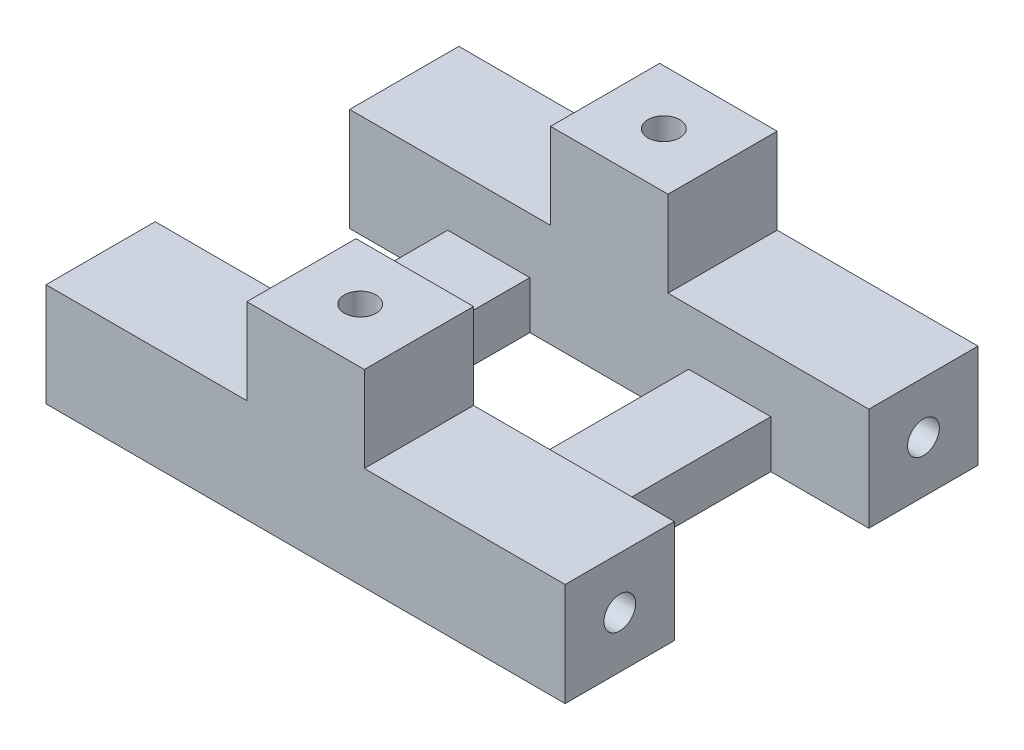
ISO-10303-21;
HEADER;
FILE_DESCRIPTION(('STEP AP214'),'2;1');
FILE_NAME('part.step','',(''),(''),'','','');
FILE_SCHEMA(('AUTOMOTIVE_DESIGN { 1 0 10303 214 1 1 1 1 }'));
ENDSEC;
DATA;
#1=APPLICATION_CONTEXT('core data for automotive mechanical design processes');
#2=APPLICATION_PROTOCOL_DEFINITION('international standard','automotive_design',2000,#1);
#3=PRODUCT_CONTEXT('',#1,'mechanical');
#4=PRODUCT('Part','Part','',(#3));
#5=PRODUCT_RELATED_PRODUCT_CATEGORY('part','',(#4));
#6=PRODUCT_DEFINITION_FORMATION('','',#4);
#7=PRODUCT_DEFINITION_CONTEXT('part definition',#1,'design');
#8=PRODUCT_DEFINITION('design','',#6,#7);
#9=PRODUCT_DEFINITION_SHAPE('','',#8);
#10=(LENGTH_UNIT() NAMED_UNIT(*) SI_UNIT(.MILLI.,.METRE.));
#11=(NAMED_UNIT(*) PLANE_ANGLE_UNIT() SI_UNIT($,.RADIAN.));
#12=(NAMED_UNIT(*) SI_UNIT($,.STERADIAN.) SOLID_ANGLE_UNIT());
#13=UNCERTAINTY_MEASURE_WITH_UNIT(LENGTH_MEASURE(1.E-05),#10,'distance_accuracy_value','');
#14=(GEOMETRIC_REPRESENTATION_CONTEXT(3) GLOBAL_UNCERTAINTY_ASSIGNED_CONTEXT((#13)) GLOBAL_UNIT_ASSIGNED_CONTEXT((#10,
#11,#12)) REPRESENTATION_CONTEXT('',''));
#15=CARTESIAN_POINT('',(0.,0.,0.));
#16=DIRECTION('',(0.,0.,1.));
#17=DIRECTION('',(1.,0.,0.));
#18=AXIS2_PLACEMENT_3D('',#15,#16,#17);
#19=CARTESIAN_POINT('',(0.,6.5,0.));
#20=DIRECTION('',(0.,1.,0.));
#21=DIRECTION('',(0.,0.,1.));
#22=AXIS2_PLACEMENT_3D('',#19,#20,#21);
#23=PLANE('',#22);
#24=DIRECTION('',(1.,0.,0.));
#25=VECTOR('',#24,1.);
#26=CARTESIAN_POINT('',(-15.6068074108547,6.5,-6.74432747551287));
#27=LINE('',#26,#25);
#28=CARTESIAN_POINT('',(-15.6068074108547,6.5,-6.74432747551287));
#29=VERTEX_POINT('',#28);
#30=CARTESIAN_POINT('',(-2.9568070293847,6.5,-6.74432747551274));
#31=VERTEX_POINT('',#30);
#32=EDGE_CURVE('E398',#29,#31,#27,.T.);
#33=ORIENTED_EDGE('',*,*,#32,.T.);
#34=DIRECTION('',(0.,0.,1.));
#35=VECTOR('',#34,1.);
#36=CARTESIAN_POINT('',(-2.9568070293847,6.5,-13.6193274755129));
#37=LINE('',#36,#35);
#38=CARTESIAN_POINT('',(-2.9568070293847,6.5,-13.6193274755129));
#39=VERTEX_POINT('',#38);
#40=EDGE_CURVE('E282',#39,#31,#37,.T.);
#41=ORIENTED_EDGE('',*,*,#40,.F.);
#42=DIRECTION('',(-1.,0.,0.));
#43=VECTOR('',#42,1.);
#44=CARTESIAN_POINT('',(17.0931933520853,6.5,-13.6193274755129));
#45=LINE('',#44,#43);
#46=CARTESIAN_POINT('',(-15.6068074108547,6.5,-13.6193274755129));
#47=VERTEX_POINT('',#46);
#48=EDGE_CURVE('E395',#39,#47,#45,.T.);
#49=ORIENTED_EDGE('',*,*,#48,.T.);
#50=DIRECTION('',(0.,0.,1.));
#51=VECTOR('',#50,1.);
#52=CARTESIAN_POINT('',(-15.6068074108547,6.5,-13.6193274755129));
#53=LINE('',#52,#51);
#54=EDGE_CURVE('E394',#47,#29,#53,.T.);
#55=ORIENTED_EDGE('',*,*,#54,.T.);
#56=EDGE_LOOP('',(#33,#41,#49,#55));
#57=FACE_BOUND('',#56,.T.);
#58=ADVANCED_FACE('F39',(#57),#23,.T.);
#59=DIRECTION('',(0.,0.,-1.));
#60=VECTOR('',#59,1.);
#61=CARTESIAN_POINT('',(4.4431929706153,6.5,-13.6193274755129));
#62=LINE('',#61,#60);
#63=CARTESIAN_POINT('',(4.4431929706153,6.5,-6.74432747551274));
#64=VERTEX_POINT('',#63);
#65=CARTESIAN_POINT('',(4.4431929706153,6.5,-13.6193274755129));
#66=VERTEX_POINT('',#65);
#67=EDGE_CURVE('E288',#64,#66,#62,.T.);
#68=ORIENTED_EDGE('',*,*,#67,.F.);
#69=DIRECTION('',(1.,0.,0.));
#70=VECTOR('',#69,1.);
#71=CARTESIAN_POINT('',(10.918193161346,6.5,-6.74432747551061));
#72=LINE('',#71,#70);
#73=CARTESIAN_POINT('',(17.0931933520853,6.5,-6.74432747551061));
#74=VERTEX_POINT('',#73);
#75=EDGE_CURVE('E417',#64,#74,#72,.T.);
#76=ORIENTED_EDGE('',*,*,#75,.T.);
#77=DIRECTION('',(0.,0.,-1.));
#78=VECTOR('',#77,1.);
#79=CARTESIAN_POINT('',(17.0931933520853,6.5,-6.74432747551061));
#80=LINE('',#79,#78);
#81=CARTESIAN_POINT('',(17.0931933520853,6.5,-13.6193274755129));
#82=VERTEX_POINT('',#81);
#83=EDGE_CURVE('E420',#74,#82,#80,.T.);
#84=ORIENTED_EDGE('',*,*,#83,.T.);
#85=EDGE_CURVE('E390',#82,#66,#45,.T.);
#86=ORIENTED_EDGE('',*,*,#85,.T.);
#87=EDGE_LOOP('',(#68,#76,#84,#86));
#88=FACE_BOUND('',#87,.T.);
#89=ADVANCED_FACE('F571',(#88),#23,.T.);
#90=DIRECTION('',(0.,0.,1.));
#91=VECTOR('',#90,1.);
#92=CARTESIAN_POINT('',(-2.9568070293847,6.5,5.50567252448682));
#93=LINE('',#92,#91);
#94=CARTESIAN_POINT('',(-2.9568070293847,6.5,5.50567252448682));
#95=VERTEX_POINT('',#94);
#96=CARTESIAN_POINT('',(-2.9568070293847,6.5,12.3806725244867));
#97=VERTEX_POINT('',#96);
#98=EDGE_CURVE('E322',#95,#97,#93,.T.);
#99=ORIENTED_EDGE('',*,*,#98,.F.);
#100=DIRECTION('',(-1.,0.,0.));
#101=VECTOR('',#100,1.);
#102=CARTESIAN_POINT('',(-9.43180722011978,6.5,5.50567252448691));
#103=LINE('',#102,#101);
#104=CARTESIAN_POINT('',(-15.606807410854,6.5,5.50567252448715));
#105=VERTEX_POINT('',#104);
#106=EDGE_CURVE('E401',#95,#105,#103,.T.);
#107=ORIENTED_EDGE('',*,*,#106,.T.);
#108=DIRECTION('',(0.,0.,1.));
#109=VECTOR('',#108,1.);
#110=CARTESIAN_POINT('',(-15.606807410854,6.5,5.50567252448715));
#111=LINE('',#110,#109);
#112=CARTESIAN_POINT('',(-15.606807410854,6.5,12.3806725244867));
#113=VERTEX_POINT('',#112);
#114=EDGE_CURVE('E404',#105,#113,#111,.T.);
#115=ORIENTED_EDGE('',*,*,#114,.T.);
#116=DIRECTION('',(1.,0.,0.));
#117=VECTOR('',#116,1.);
#118=CARTESIAN_POINT('',(-15.606807410854,6.5,12.3806725244867));
#119=LINE('',#118,#117);
#120=EDGE_CURVE('E408',#113,#97,#119,.T.);
#121=ORIENTED_EDGE('',*,*,#120,.T.);
#122=EDGE_LOOP('',(#99,#107,#115,#121));
#123=FACE_BOUND('',#122,.T.);
#124=ADVANCED_FACE('F523',(#123),#23,.T.);
#125=DIRECTION('',(-1.,0.,0.));
#126=VECTOR('',#125,1.);
#127=CARTESIAN_POINT('',(17.093193352086,6.5,5.50567252448893));
#128=LINE('',#127,#126);
#129=CARTESIAN_POINT('',(17.093193352086,6.5,5.50567252448893));
#130=VERTEX_POINT('',#129);
#131=CARTESIAN_POINT('',(4.4431929706153,6.5,5.50567252448682));
#132=VERTEX_POINT('',#131);
#133=EDGE_CURVE('E414',#130,#132,#128,.T.);
#134=ORIENTED_EDGE('',*,*,#133,.T.);
#135=DIRECTION('',(0.,0.,-1.));
#136=VECTOR('',#135,1.);
#137=CARTESIAN_POINT('',(4.4431929706153,6.5,5.50567252448682));
#138=LINE('',#137,#136);
#139=CARTESIAN_POINT('',(4.4431929706153,6.5,12.3806725244867));
#140=VERTEX_POINT('',#139);
#141=EDGE_CURVE('E331',#140,#132,#138,.T.);
#142=ORIENTED_EDGE('',*,*,#141,.F.);
#143=CARTESIAN_POINT('',(17.093193352086,6.5,12.3806725244867));
#144=VERTEX_POINT('',#143);
#145=EDGE_CURVE('E407',#140,#144,#119,.T.);
#146=ORIENTED_EDGE('',*,*,#145,.T.);
#147=DIRECTION('',(0.,0.,-1.));
#148=VECTOR('',#147,1.);
#149=CARTESIAN_POINT('',(17.093193352086,6.5,12.3806725244867));
#150=LINE('',#149,#148);
#151=EDGE_CURVE('E411',#144,#130,#150,.T.);
#152=ORIENTED_EDGE('',*,*,#151,.T.);
#153=EDGE_LOOP('',(#134,#142,#146,#152));
#154=FACE_BOUND('',#153,.T.);
#155=ADVANCED_FACE('F493',(#154),#23,.T.);
#156=CARTESIAN_POINT('',(0.,0.,0.));
#157=DIRECTION('',(0.,1.,0.));
#158=DIRECTION('',(0.,0.,1.));
#159=AXIS2_PLACEMENT_3D('',#156,#157,#158);
#160=PLANE('',#159);
#161=DIRECTION('',(-1.,0.,0.));
#162=VECTOR('',#161,1.);
#163=CARTESIAN_POINT('',(17.0931933520853,0.,-13.6193274755129));
#164=LINE('',#163,#162);
#165=CARTESIAN_POINT('',(17.0931933520853,0.,-13.6193274755129));
#166=VERTEX_POINT('',#165);
#167=CARTESIAN_POINT('',(-15.6068074108547,0.,-13.6193274755129));
#168=VERTEX_POINT('',#167);
#169=EDGE_CURVE('E389',#166,#168,#164,.T.);
#170=ORIENTED_EDGE('',*,*,#169,.F.);
#171=DIRECTION('',(0.,0.,-1.));
#172=VECTOR('',#171,1.);
#173=CARTESIAN_POINT('',(17.0931933520853,0.,-6.74432747551061));
#174=LINE('',#173,#172);
#175=CARTESIAN_POINT('',(17.0931933520853,0.,-6.74432747551061));
#176=VERTEX_POINT('',#175);
#177=EDGE_CURVE('E461',#176,#166,#174,.T.);
#178=ORIENTED_EDGE('',*,*,#177,.F.);
#179=DIRECTION('',(1.,0.,0.));
#180=VECTOR('',#179,1.);
#181=CARTESIAN_POINT('',(10.918193161346,0.,-6.74432747551061));
#182=LINE('',#181,#180);
#183=CARTESIAN_POINT('',(10.918193161346,0.,-6.74432747551061));
#184=VERTEX_POINT('',#183);
#185=EDGE_CURVE('E458',#184,#176,#182,.T.);
#186=ORIENTED_EDGE('',*,*,#185,.F.);
#187=DIRECTION('',(0.,0.,-1.));
#188=VECTOR('',#187,1.);
#189=CARTESIAN_POINT('',(10.918193161346,0.,5.50567252448893));
#190=LINE('',#189,#188);
#191=CARTESIAN_POINT('',(10.918193161346,0.,5.50567252448893));
#192=VERTEX_POINT('',#191);
#193=EDGE_CURVE('E225',#192,#184,#190,.T.);
#194=ORIENTED_EDGE('',*,*,#193,.F.);
#195=DIRECTION('',(-1.,0.,0.));
#196=VECTOR('',#195,1.);
#197=CARTESIAN_POINT('',(17.093193352086,0.,5.50567252448893));
#198=LINE('',#197,#196);
#199=CARTESIAN_POINT('',(17.093193352086,0.,5.50567252448893));
#200=VERTEX_POINT('',#199);
#201=EDGE_CURVE('E452',#200,#192,#198,.T.);
#202=ORIENTED_EDGE('',*,*,#201,.F.);
#203=DIRECTION('',(0.,0.,-1.));
#204=VECTOR('',#203,1.);
#205=CARTESIAN_POINT('',(17.093193352086,0.,12.3806725244867));
#206=LINE('',#205,#204);
#207=CARTESIAN_POINT('',(17.093193352086,0.,12.3806725244867));
#208=VERTEX_POINT('',#207);
#209=EDGE_CURVE('E448',#208,#200,#206,.T.);
#210=ORIENTED_EDGE('',*,*,#209,.F.);
#211=DIRECTION('',(1.,0.,0.));
#212=VECTOR('',#211,1.);
#213=CARTESIAN_POINT('',(-15.606807410854,0.,12.3806725244867));
#214=LINE('',#213,#212);
#215=CARTESIAN_POINT('',(-15.606807410854,0.,12.3806725244867));
#216=VERTEX_POINT('',#215);
#217=EDGE_CURVE('E445',#216,#208,#214,.T.);
#218=ORIENTED_EDGE('',*,*,#217,.F.);
#219=DIRECTION('',(0.,0.,1.));
#220=VECTOR('',#219,1.);
#221=CARTESIAN_POINT('',(-15.606807410854,0.,5.50567252448715));
#222=LINE('',#221,#220);
#223=CARTESIAN_POINT('',(-15.606807410854,0.,5.50567252448715));
#224=VERTEX_POINT('',#223);
#225=EDGE_CURVE('E442',#224,#216,#222,.T.);
#226=ORIENTED_EDGE('',*,*,#225,.F.);
#227=DIRECTION('',(-1.,0.,0.));
#228=VECTOR('',#227,1.);
#229=CARTESIAN_POINT('',(-9.43180722011978,0.,5.50567252448691));
#230=LINE('',#229,#228);
#231=CARTESIAN_POINT('',(-9.43180722011978,0.,5.50567252448691));
#232=VERTEX_POINT('',#231);
#233=EDGE_CURVE('E438',#232,#224,#230,.T.);
#234=ORIENTED_EDGE('',*,*,#233,.F.);
#235=DIRECTION('',(0.,0.,1.));
#236=VECTOR('',#235,1.);
#237=CARTESIAN_POINT('',(-9.43180722011978,0.,-6.74432747551287));
#238=LINE('',#237,#236);
#239=CARTESIAN_POINT('',(-9.43180722011978,0.,-6.74432747551287));
#240=VERTEX_POINT('',#239);
#241=EDGE_CURVE('E434',#240,#232,#238,.T.);
#242=ORIENTED_EDGE('',*,*,#241,.F.);
#243=DIRECTION('',(1.,0.,0.));
#244=VECTOR('',#243,1.);
#245=CARTESIAN_POINT('',(-15.6068074108547,0.,-6.74432747551287));
#246=LINE('',#245,#244);
#247=CARTESIAN_POINT('',(-15.6068074108547,0.,-6.74432747551287));
#248=VERTEX_POINT('',#247);
#249=EDGE_CURVE('E430',#248,#240,#246,.T.);
#250=ORIENTED_EDGE('',*,*,#249,.F.);
#251=DIRECTION('',(0.,0.,1.));
#252=VECTOR('',#251,1.);
#253=CARTESIAN_POINT('',(-15.6068074108547,0.,-13.6193274755129));
#254=LINE('',#253,#252);
#255=EDGE_CURVE('E426',#168,#248,#254,.T.);
#256=ORIENTED_EDGE('',*,*,#255,.F.);
#257=EDGE_LOOP('',(#170,#178,#186,#194,#202,#210,#218,#226,#234,#242,#250,#256));
#258=FACE_BOUND('',#257,.T.);
#259=DIRECTION('',(0.,0.,1.));
#260=VECTOR('',#259,1.);
#261=CARTESIAN_POINT('',(-4.25680702938396,0.,-6.74432747551274));
#262=LINE('',#261,#260);
#263=CARTESIAN_POINT('',(-4.25680702938396,0.,-6.74432747551274));
#264=VERTEX_POINT('',#263);
#265=CARTESIAN_POINT('',(-4.25680702938396,0.,5.50567252448682));
#266=VERTEX_POINT('',#265);
#267=EDGE_CURVE('E362',#264,#266,#262,.T.);
#268=ORIENTED_EDGE('',*,*,#267,.T.);
#269=DIRECTION('',(1.,0.,0.));
#270=VECTOR('',#269,1.);
#271=CARTESIAN_POINT('',(-4.25680702938396,0.,5.50567252448682));
#272=LINE('',#271,#270);
#273=CARTESIAN_POINT('',(5.74319297061473,0.,5.50567252448682));
#274=VERTEX_POINT('',#273);
#275=EDGE_CURVE('E366',#266,#274,#272,.T.);
#276=ORIENTED_EDGE('',*,*,#275,.T.);
#277=DIRECTION('',(0.,0.,-1.));
#278=VECTOR('',#277,1.);
#279=CARTESIAN_POINT('',(5.74319297061473,0.,-6.74432747551274));
#280=LINE('',#279,#278);
#281=CARTESIAN_POINT('',(5.74319297061473,0.,-6.74432747551274));
#282=VERTEX_POINT('',#281);
#283=EDGE_CURVE('E370',#274,#282,#280,.T.);
#284=ORIENTED_EDGE('',*,*,#283,.T.);
#285=DIRECTION('',(-1.,0.,0.));
#286=VECTOR('',#285,1.);
#287=CARTESIAN_POINT('',(-4.25680702938396,0.,-6.74432747551274));
#288=LINE('',#287,#286);
#289=EDGE_CURVE('E374',#282,#264,#288,.T.);
#290=ORIENTED_EDGE('',*,*,#289,.T.);
#291=EDGE_LOOP('',(#268,#276,#284,#290));
#292=FACE_BOUND('',#291,.T.);
#293=ADVANCED_FACE('F474',(#258,#292),#160,.F.);
#294=CARTESIAN_POINT('',(17.0931933520853,6.5,-13.6193274755129));
#295=DIRECTION('',(0.,0.,1.));
#296=DIRECTION('',(1.,0.,0.));
#297=AXIS2_PLACEMENT_3D('',#294,#295,#296);
#298=PLANE('',#297);
#299=ORIENTED_EDGE('',*,*,#169,.T.);
#300=DIRECTION('',(0.,-1.,0.));
#301=VECTOR('',#300,1.);
#302=CARTESIAN_POINT('',(-15.6068074108547,6.5,-13.6193274755129));
#303=LINE('',#302,#301);
#304=EDGE_CURVE('E49',#47,#168,#303,.T.);
#305=ORIENTED_EDGE('',*,*,#304,.F.);
#306=ORIENTED_EDGE('',*,*,#48,.F.);
#307=DIRECTION('',(0.,-1.,0.));
#308=VECTOR('',#307,1.);
#309=CARTESIAN_POINT('',(-2.9568070293847,11.9,-13.6193274755129));
#310=LINE('',#309,#308);
#311=CARTESIAN_POINT('',(-2.9568070293847,11.9,-13.6193274755129));
#312=VERTEX_POINT('',#311);
#313=EDGE_CURVE('E297',#312,#39,#310,.T.);
#314=ORIENTED_EDGE('',*,*,#313,.F.);
#315=DIRECTION('',(-1.,0.,0.));
#316=VECTOR('',#315,1.);
#317=CARTESIAN_POINT('',(-2.9568070293847,11.9,-13.6193274755129));
#318=LINE('',#317,#316);
#319=CARTESIAN_POINT('',(4.4431929706153,11.9,-13.6193274755129));
#320=VERTEX_POINT('',#319);
#321=EDGE_CURVE('E294',#320,#312,#318,.T.);
#322=ORIENTED_EDGE('',*,*,#321,.F.);
#323=DIRECTION('',(0.,-1.,0.));
#324=VECTOR('',#323,1.);
#325=CARTESIAN_POINT('',(4.4431929706153,11.9,-13.6193274755129));
#326=LINE('',#325,#324);
#327=EDGE_CURVE('E305',#320,#66,#326,.T.);
#328=ORIENTED_EDGE('',*,*,#327,.T.);
#329=ORIENTED_EDGE('',*,*,#85,.F.);
#330=DIRECTION('',(0.,-1.,0.));
#331=VECTOR('',#330,1.);
#332=CARTESIAN_POINT('',(17.0931933520853,6.5,-13.6193274755129));
#333=LINE('',#332,#331);
#334=EDGE_CURVE('E235',#82,#166,#333,.T.);
#335=ORIENTED_EDGE('',*,*,#334,.T.);
#336=EDGE_LOOP('',(#299,#305,#306,#314,#322,#328,#329,#335));
#337=FACE_BOUND('',#336,.T.);
#338=ADVANCED_FACE('F41',(#337),#298,.F.);
#339=CARTESIAN_POINT('',(-15.6068074108547,6.5,-13.6193274755129));
#340=DIRECTION('',(1.,0.,0.));
#341=DIRECTION('',(0.,0.,-1.));
#342=AXIS2_PLACEMENT_3D('',#339,#340,#341);
#343=PLANE('',#342);
#344=CARTESIAN_POINT('',(-15.6068074108547,3.25,-10.1818274755129));
#345=DIRECTION('',(-1.,0.,0.));
#346=DIRECTION('',(0.,0.,1.));
#347=AXIS2_PLACEMENT_3D('',#344,#345,#346);
#348=CIRCLE('',#347,1.);
#349=CARTESIAN_POINT('',(-15.6068074108547,3.25,-9.18182747551287));
#350=VERTEX_POINT('',#349);
#351=EDGE_CURVE('E547',#350,#350,#348,.T.);
#352=ORIENTED_EDGE('',*,*,#351,.F.);
#353=EDGE_LOOP('',(#352));
#354=FACE_BOUND('',#353,.T.);
#355=ORIENTED_EDGE('',*,*,#255,.T.);
#356=DIRECTION('',(0.,-1.,0.));
#357=VECTOR('',#356,1.);
#358=CARTESIAN_POINT('',(-15.6068074108547,6.5,-6.74432747551287));
#359=LINE('',#358,#357);
#360=EDGE_CURVE('E258',#29,#248,#359,.T.);
#361=ORIENTED_EDGE('',*,*,#360,.F.);
#362=ORIENTED_EDGE('',*,*,#54,.F.);
#363=ORIENTED_EDGE('',*,*,#304,.T.);
#364=EDGE_LOOP('',(#355,#361,#362,#363));
#365=FACE_BOUND('',#364,.T.);
#366=ADVANCED_FACE('F481',(#354,#365),#343,.F.);
#367=CARTESIAN_POINT('',(-9.43180722011978,6.5,-6.74432747551287));
#368=DIRECTION('',(1.,0.,0.));
#369=DIRECTION('',(0.,0.,-1.));
#370=AXIS2_PLACEMENT_3D('',#367,#368,#369);
#371=PLANE('',#370);
#372=DIRECTION('',(0.,-1.,0.));
#373=VECTOR('',#372,1.);
#374=CARTESIAN_POINT('',(-9.43180722011978,6.5,5.50567252448691));
#375=LINE('',#374,#373);
#376=CARTESIAN_POINT('',(-9.43180722011978,3.,5.50567252448715));
#377=VERTEX_POINT('',#376);
#378=EDGE_CURVE('E252',#377,#232,#375,.T.);
#379=ORIENTED_EDGE('',*,*,#378,.F.);
#380=DIRECTION('',(0.,0.,-1.));
#381=VECTOR('',#380,1.);
#382=CARTESIAN_POINT('',(-9.43180722011978,3.,-6.74432747551287));
#383=LINE('',#382,#381);
#384=CARTESIAN_POINT('',(-9.43180722011978,3.,-6.74432747551287));
#385=VERTEX_POINT('',#384);
#386=EDGE_CURVE('E209',#377,#385,#383,.T.);
#387=ORIENTED_EDGE('',*,*,#386,.T.);
#388=DIRECTION('',(0.,-1.,0.));
#389=VECTOR('',#388,1.);
#390=CARTESIAN_POINT('',(-9.43180722011978,6.5,-6.74432747551287));
#391=LINE('',#390,#389);
#392=EDGE_CURVE('E255',#385,#240,#391,.T.);
#393=ORIENTED_EDGE('',*,*,#392,.T.);
#394=ORIENTED_EDGE('',*,*,#241,.T.);
#395=EDGE_LOOP('',(#379,#387,#393,#394));
#396=FACE_BOUND('',#395,.T.);
#397=ADVANCED_FACE('F563',(#396),#371,.F.);
#398=CARTESIAN_POINT('',(-15.606807410854,6.5,5.50567252448715));
#399=DIRECTION('',(1.,0.,0.));
#400=DIRECTION('',(0.,0.,-1.));
#401=AXIS2_PLACEMENT_3D('',#398,#399,#400);
#402=PLANE('',#401);
#403=CARTESIAN_POINT('',(-15.6068074108547,3.25,8.9431725244869));
#404=DIRECTION('',(-1.,0.,0.));
#405=DIRECTION('',(0.,0.,1.));
#406=AXIS2_PLACEMENT_3D('',#403,#404,#405);
#407=CIRCLE('',#406,1.);
#408=CARTESIAN_POINT('',(-15.6068074108547,3.25,9.94317252448691));
#409=VERTEX_POINT('',#408);
#410=EDGE_CURVE('E534',#409,#409,#407,.T.);
#411=ORIENTED_EDGE('',*,*,#410,.F.);
#412=EDGE_LOOP('',(#411));
#413=FACE_BOUND('',#412,.T.);
#414=ORIENTED_EDGE('',*,*,#225,.T.);
#415=DIRECTION('',(0.,-1.,0.));
#416=VECTOR('',#415,1.);
#417=CARTESIAN_POINT('',(-15.606807410854,6.5,12.3806725244867));
#418=LINE('',#417,#416);
#419=EDGE_CURVE('E245',#113,#216,#418,.T.);
#420=ORIENTED_EDGE('',*,*,#419,.F.);
#421=ORIENTED_EDGE('',*,*,#114,.F.);
#422=DIRECTION('',(0.,-1.,0.));
#423=VECTOR('',#422,1.);
#424=CARTESIAN_POINT('',(-15.606807410854,6.5,5.50567252448715));
#425=LINE('',#424,#423);
#426=EDGE_CURVE('E249',#105,#224,#425,.T.);
#427=ORIENTED_EDGE('',*,*,#426,.T.);
#428=EDGE_LOOP('',(#414,#420,#421,#427));
#429=FACE_BOUND('',#428,.T.);
#430=ADVANCED_FACE('F568',(#413,#429),#402,.F.);
#431=CARTESIAN_POINT('',(-15.606807410854,6.5,12.3806725244867));
#432=DIRECTION('',(0.,0.,-1.));
#433=DIRECTION('',(-1.,0.,0.));
#434=AXIS2_PLACEMENT_3D('',#431,#432,#433);
#435=PLANE('',#434);
#436=ORIENTED_EDGE('',*,*,#217,.T.);
#437=DIRECTION('',(0.,-1.,0.));
#438=VECTOR('',#437,1.);
#439=CARTESIAN_POINT('',(17.093193352086,6.5,12.3806725244867));
#440=LINE('',#439,#438);
#441=EDGE_CURVE('E241',#144,#208,#440,.T.);
#442=ORIENTED_EDGE('',*,*,#441,.F.);
#443=ORIENTED_EDGE('',*,*,#145,.F.);
#444=DIRECTION('',(0.,-1.,0.));
#445=VECTOR('',#444,1.);
#446=CARTESIAN_POINT('',(4.4431929706153,11.9,12.3806725244867));
#447=LINE('',#446,#445);
#448=CARTESIAN_POINT('',(4.4431929706153,11.9,12.3806725244867));
#449=VERTEX_POINT('',#448);
#450=EDGE_CURVE('E354',#449,#140,#447,.T.);
#451=ORIENTED_EDGE('',*,*,#450,.F.);
#452=DIRECTION('',(1.,0.,0.));
#453=VECTOR('',#452,1.);
#454=CARTESIAN_POINT('',(-2.9568070293847,11.9,12.3806725244867));
#455=LINE('',#454,#453);
#456=CARTESIAN_POINT('',(-2.9568070293847,11.9,12.3806725244867));
#457=VERTEX_POINT('',#456);
#458=EDGE_CURVE('E330',#457,#449,#455,.T.);
#459=ORIENTED_EDGE('',*,*,#458,.F.);
#460=DIRECTION('',(0.,-1.,0.));
#461=VECTOR('',#460,1.);
#462=CARTESIAN_POINT('',(-2.9568070293847,11.9,12.3806725244867));
#463=LINE('',#462,#461);
#464=EDGE_CURVE('E358',#457,#97,#463,.T.);
#465=ORIENTED_EDGE('',*,*,#464,.T.);
#466=ORIENTED_EDGE('',*,*,#120,.F.);
#467=ORIENTED_EDGE('',*,*,#419,.T.);
#468=EDGE_LOOP('',(#436,#442,#443,#451,#459,#465,#466,#467));
#469=FACE_BOUND('',#468,.T.);
#470=ADVANCED_FACE('F498',(#469),#435,.F.);
#471=CARTESIAN_POINT('',(17.093193352086,6.5,12.3806725244867));
#472=DIRECTION('',(-1.,0.,0.));
#473=DIRECTION('',(0.,0.,1.));
#474=AXIS2_PLACEMENT_3D('',#471,#472,#473);
#475=PLANE('',#474);
#476=CARTESIAN_POINT('',(17.093193352086,3.25,8.9431725244869));
#477=DIRECTION('',(-1.,0.,0.));
#478=DIRECTION('',(0.,0.,1.));
#479=AXIS2_PLACEMENT_3D('',#476,#477,#478);
#480=CIRCLE('',#479,1.);
#481=CARTESIAN_POINT('',(17.093193352086,3.25,9.94317252448691));
#482=VERTEX_POINT('',#481);
#483=EDGE_CURVE('E43',#482,#482,#480,.T.);
#484=ORIENTED_EDGE('',*,*,#483,.T.);
#485=EDGE_LOOP('',(#484));
#486=FACE_BOUND('',#485,.T.);
#487=ORIENTED_EDGE('',*,*,#209,.T.);
#488=DIRECTION('',(0.,-1.,0.));
#489=VECTOR('',#488,1.);
#490=CARTESIAN_POINT('',(17.093193352086,6.5,5.50567252448893));
#491=LINE('',#490,#489);
#492=EDGE_CURVE('E233',#130,#200,#491,.T.);
#493=ORIENTED_EDGE('',*,*,#492,.F.);
#494=ORIENTED_EDGE('',*,*,#151,.F.);
#495=ORIENTED_EDGE('',*,*,#441,.T.);
#496=EDGE_LOOP('',(#487,#493,#494,#495));
#497=FACE_BOUND('',#496,.T.);
#498=ADVANCED_FACE('F502',(#486,#497),#475,.F.);
#499=CARTESIAN_POINT('',(17.093193352086,6.5,5.50567252448893));
#500=DIRECTION('',(0.,0.,1.));
#501=DIRECTION('',(1.,0.,0.));
#502=AXIS2_PLACEMENT_3D('',#499,#500,#501);
#503=PLANE('',#502);
#504=DIRECTION('',(0.,-1.,0.));
#505=VECTOR('',#504,1.);
#506=CARTESIAN_POINT('',(10.918193161346,6.5,5.50567252448893));
#507=LINE('',#506,#505);
#508=CARTESIAN_POINT('',(10.918193161346,3.,5.50567252448715));
#509=VERTEX_POINT('',#508);
#510=EDGE_CURVE('E228',#509,#192,#507,.T.);
#511=ORIENTED_EDGE('',*,*,#510,.F.);
#512=DIRECTION('',(-1.,0.,0.));
#513=VECTOR('',#512,1.);
#514=CARTESIAN_POINT('',(19.7931925891453,3.,5.50567252448715));
#515=LINE('',#514,#513);
#516=CARTESIAN_POINT('',(5.74319297061473,3.,5.50567252448715));
#517=VERTEX_POINT('',#516);
#518=EDGE_CURVE('E204',#509,#517,#515,.T.);
#519=ORIENTED_EDGE('',*,*,#518,.T.);
#520=DIRECTION('',(0.,-1.,0.));
#521=VECTOR('',#520,1.);
#522=CARTESIAN_POINT('',(5.74319297061473,6.5,5.50567252448682));
#523=LINE('',#522,#521);
#524=EDGE_CURVE('E383',#517,#274,#523,.T.);
#525=ORIENTED_EDGE('',*,*,#524,.T.);
#526=ORIENTED_EDGE('',*,*,#275,.F.);
#527=DIRECTION('',(0.,-1.,0.));
#528=VECTOR('',#527,1.);
#529=CARTESIAN_POINT('',(-4.25680702938396,6.5,5.50567252448682));
#530=LINE('',#529,#528);
#531=CARTESIAN_POINT('',(-4.25680702938396,3.,5.50567252448682));
#532=VERTEX_POINT('',#531);
#533=EDGE_CURVE('E386',#532,#266,#530,.T.);
#534=ORIENTED_EDGE('',*,*,#533,.F.);
#535=EDGE_CURVE('E57',#532,#377,#515,.T.);
#536=ORIENTED_EDGE('',*,*,#535,.T.);
#537=ORIENTED_EDGE('',*,*,#378,.T.);
#538=ORIENTED_EDGE('',*,*,#233,.T.);
#539=ORIENTED_EDGE('',*,*,#426,.F.);
#540=ORIENTED_EDGE('',*,*,#106,.F.);
#541=DIRECTION('',(0.,-1.,0.));
#542=VECTOR('',#541,1.);
#543=CARTESIAN_POINT('',(-2.9568070293847,11.9,5.50567252448682));
#544=LINE('',#543,#542);
#545=CARTESIAN_POINT('',(-2.9568070293847,11.9,5.50567252448682));
#546=VERTEX_POINT('',#545);
#547=EDGE_CURVE('E340',#546,#95,#544,.T.);
#548=ORIENTED_EDGE('',*,*,#547,.F.);
#549=DIRECTION('',(-1.,0.,0.));
#550=VECTOR('',#549,1.);
#551=CARTESIAN_POINT('',(-2.9568070293847,11.9,5.50567252448682));
#552=LINE('',#551,#550);
#553=CARTESIAN_POINT('',(4.4431929706153,11.9,5.50567252448682));
#554=VERTEX_POINT('',#553);
#555=EDGE_CURVE('E337',#554,#546,#552,.T.);
#556=ORIENTED_EDGE('',*,*,#555,.F.);
#557=DIRECTION('',(0.,-1.,0.));
#558=VECTOR('',#557,1.);
#559=CARTESIAN_POINT('',(4.4431929706153,11.9,5.50567252448682));
#560=LINE('',#559,#558);
#561=EDGE_CURVE('E350',#554,#132,#560,.T.);
#562=ORIENTED_EDGE('',*,*,#561,.T.);
#563=ORIENTED_EDGE('',*,*,#133,.F.);
#564=ORIENTED_EDGE('',*,*,#492,.T.);
#565=ORIENTED_EDGE('',*,*,#201,.T.);
#566=EDGE_LOOP('',(#511,#519,#525,#526,#534,#536,#537,#538,#539,#540,#548,#556,#562,#563,#564,#565));
#567=FACE_BOUND('',#566,.T.);
#568=ADVANCED_FACE('F506',(#567),#503,.F.);
#569=CARTESIAN_POINT('',(10.918193161346,6.5,5.50567252448893));
#570=DIRECTION('',(-1.,0.,0.));
#571=DIRECTION('',(0.,0.,1.));
#572=AXIS2_PLACEMENT_3D('',#569,#570,#571);
#573=PLANE('',#572);
#574=DIRECTION('',(0.,-1.,0.));
#575=VECTOR('',#574,1.);
#576=CARTESIAN_POINT('',(10.918193161346,6.5,-6.74432747551061));
#577=LINE('',#576,#575);
#578=CARTESIAN_POINT('',(10.918193161346,3.,-6.74432747551287));
#579=VERTEX_POINT('',#578);
#580=EDGE_CURVE('E216',#579,#184,#577,.T.);
#581=ORIENTED_EDGE('',*,*,#580,.F.);
#582=DIRECTION('',(0.,0.,1.));
#583=VECTOR('',#582,1.);
#584=CARTESIAN_POINT('',(10.918193161346,3.,5.50567252448893));
#585=LINE('',#584,#583);
#586=EDGE_CURVE('E201',#579,#509,#585,.T.);
#587=ORIENTED_EDGE('',*,*,#586,.T.);
#588=ORIENTED_EDGE('',*,*,#510,.T.);
#589=ORIENTED_EDGE('',*,*,#193,.T.);
#590=EDGE_LOOP('',(#581,#587,#588,#589));
#591=FACE_BOUND('',#590,.T.);
#592=ADVANCED_FACE('F223',(#591),#573,.F.);
#593=CARTESIAN_POINT('',(10.918193161346,6.5,-6.74432747551061));
#594=DIRECTION('',(0.,0.,-1.));
#595=DIRECTION('',(-1.,0.,0.));
#596=AXIS2_PLACEMENT_3D('',#593,#594,#595);
#597=PLANE('',#596);
#598=ORIENTED_EDGE('',*,*,#185,.T.);
#599=DIRECTION('',(0.,-1.,0.));
#600=VECTOR('',#599,1.);
#601=CARTESIAN_POINT('',(17.0931933520853,6.5,-6.74432747551061));
#602=LINE('',#601,#600);
#603=EDGE_CURVE('E229',#74,#176,#602,.T.);
#604=ORIENTED_EDGE('',*,*,#603,.F.);
#605=ORIENTED_EDGE('',*,*,#75,.F.);
#606=DIRECTION('',(0.,-1.,0.));
#607=VECTOR('',#606,1.);
#608=CARTESIAN_POINT('',(4.4431929706153,11.9,-6.74432747551274));
#609=LINE('',#608,#607);
#610=CARTESIAN_POINT('',(4.4431929706153,11.9,-6.74432747551274));
#611=VERTEX_POINT('',#610);
#612=EDGE_CURVE('E309',#611,#64,#609,.T.);
#613=ORIENTED_EDGE('',*,*,#612,.F.);
#614=DIRECTION('',(1.,0.,0.));
#615=VECTOR('',#614,1.);
#616=CARTESIAN_POINT('',(-2.9568070293847,11.9,-6.74432747551274));
#617=LINE('',#616,#615);
#618=CARTESIAN_POINT('',(-2.9568070293847,11.9,-6.74432747551274));
#619=VERTEX_POINT('',#618);
#620=EDGE_CURVE('E287',#619,#611,#617,.T.);
#621=ORIENTED_EDGE('',*,*,#620,.F.);
#622=DIRECTION('',(0.,-1.,0.));
#623=VECTOR('',#622,1.);
#624=CARTESIAN_POINT('',(-2.9568070293847,11.9,-6.74432747551274));
#625=LINE('',#624,#623);
#626=EDGE_CURVE('E313',#619,#31,#625,.T.);
#627=ORIENTED_EDGE('',*,*,#626,.T.);
#628=ORIENTED_EDGE('',*,*,#32,.F.);
#629=ORIENTED_EDGE('',*,*,#360,.T.);
#630=ORIENTED_EDGE('',*,*,#249,.T.);
#631=ORIENTED_EDGE('',*,*,#392,.F.);
#632=DIRECTION('',(-1.,0.,0.));
#633=VECTOR('',#632,1.);
#634=CARTESIAN_POINT('',(19.7931925891453,3.,-6.74432747551287));
#635=LINE('',#634,#633);
#636=CARTESIAN_POINT('',(-4.25680702938397,3.,-6.74432747551287));
#637=VERTEX_POINT('',#636);
#638=EDGE_CURVE('E221',#637,#385,#635,.T.);
#639=ORIENTED_EDGE('',*,*,#638,.F.);
#640=DIRECTION('',(0.,-1.,0.));
#641=VECTOR('',#640,1.);
#642=CARTESIAN_POINT('',(-4.25680702938396,6.5,-6.74432747551274));
#643=LINE('',#642,#641);
#644=EDGE_CURVE('E378',#637,#264,#643,.T.);
#645=ORIENTED_EDGE('',*,*,#644,.T.);
#646=ORIENTED_EDGE('',*,*,#289,.F.);
#647=DIRECTION('',(0.,-1.,0.));
#648=VECTOR('',#647,1.);
#649=CARTESIAN_POINT('',(5.74319297061473,6.5,-6.74432747551274));
#650=LINE('',#649,#648);
#651=CARTESIAN_POINT('',(5.74319297061473,3.,-6.74432747551274));
#652=VERTEX_POINT('',#651);
#653=EDGE_CURVE('E219',#652,#282,#650,.T.);
#654=ORIENTED_EDGE('',*,*,#653,.F.);
#655=EDGE_CURVE('E65',#579,#652,#635,.T.);
#656=ORIENTED_EDGE('',*,*,#655,.F.);
#657=ORIENTED_EDGE('',*,*,#580,.T.);
#658=EDGE_LOOP('',(#598,#604,#605,#613,#621,#627,#628,#629,#630,#631,#639,#645,#646,#654,#656,#657));
#659=FACE_BOUND('',#658,.T.);
#660=ADVANCED_FACE('F215',(#659),#597,.F.);
#661=CARTESIAN_POINT('',(17.0931933520853,6.5,-6.74432747551061));
#662=DIRECTION('',(-1.,0.,0.));
#663=DIRECTION('',(0.,0.,1.));
#664=AXIS2_PLACEMENT_3D('',#661,#662,#663);
#665=PLANE('',#664);
#666=CARTESIAN_POINT('',(17.0931933520853,3.25,-10.1818274755129));
#667=DIRECTION('',(-1.,0.,0.));
#668=DIRECTION('',(0.,0.,1.));
#669=AXIS2_PLACEMENT_3D('',#666,#667,#668);
#670=CIRCLE('',#669,1.);
#671=CARTESIAN_POINT('',(17.0931933520853,3.25,-9.18182747551287));
#672=VERTEX_POINT('',#671);
#673=EDGE_CURVE('E263',#672,#672,#670,.T.);
#674=ORIENTED_EDGE('',*,*,#673,.T.);
#675=EDGE_LOOP('',(#674));
#676=FACE_BOUND('',#675,.T.);
#677=ORIENTED_EDGE('',*,*,#177,.T.);
#678=ORIENTED_EDGE('',*,*,#334,.F.);
#679=ORIENTED_EDGE('',*,*,#83,.F.);
#680=ORIENTED_EDGE('',*,*,#603,.T.);
#681=EDGE_LOOP('',(#677,#678,#679,#680));
#682=FACE_BOUND('',#681,.T.);
#683=ADVANCED_FACE('F631',(#676,#682),#665,.F.);
#684=CARTESIAN_POINT('',(-4.25680702938396,6.5,-6.74432747551274));
#685=DIRECTION('',(1.,0.,0.));
#686=DIRECTION('',(0.,0.,-1.));
#687=AXIS2_PLACEMENT_3D('',#684,#685,#686);
#688=PLANE('',#687);
#689=DIRECTION('',(0.,0.,-1.));
#690=VECTOR('',#689,1.);
#691=CARTESIAN_POINT('',(-4.25680702938396,3.,-6.74432747551274));
#692=LINE('',#691,#690);
#693=EDGE_CURVE('E210',#532,#637,#692,.T.);
#694=ORIENTED_EDGE('',*,*,#693,.F.);
#695=ORIENTED_EDGE('',*,*,#533,.T.);
#696=ORIENTED_EDGE('',*,*,#267,.F.);
#697=ORIENTED_EDGE('',*,*,#644,.F.);
#698=EDGE_LOOP('',(#694,#695,#696,#697));
#699=FACE_BOUND('',#698,.T.);
#700=ADVANCED_FACE('F542',(#699),#688,.T.);
#701=CARTESIAN_POINT('',(5.74319297061473,6.5,-6.74432747551274));
#702=DIRECTION('',(-1.,0.,0.));
#703=DIRECTION('',(0.,0.,1.));
#704=AXIS2_PLACEMENT_3D('',#701,#702,#703);
#705=PLANE('',#704);
#706=DIRECTION('',(0.,0.,1.));
#707=VECTOR('',#706,1.);
#708=CARTESIAN_POINT('',(5.74319297061473,3.,-6.74432747551274));
#709=LINE('',#708,#707);
#710=EDGE_CURVE('E538',#652,#517,#709,.T.);
#711=ORIENTED_EDGE('',*,*,#710,.F.);
#712=ORIENTED_EDGE('',*,*,#653,.T.);
#713=ORIENTED_EDGE('',*,*,#283,.F.);
#714=ORIENTED_EDGE('',*,*,#524,.F.);
#715=EDGE_LOOP('',(#711,#712,#713,#714));
#716=FACE_BOUND('',#715,.T.);
#717=ADVANCED_FACE('F537',(#716),#705,.T.);
#718=CARTESIAN_POINT('',(0.,11.9,0.));
#719=DIRECTION('',(0.,1.,0.));
#720=DIRECTION('',(0.,0.,1.));
#721=AXIS2_PLACEMENT_3D('',#718,#719,#720);
#722=PLANE('',#721);
#723=DIRECTION('',(0.,0.,1.));
#724=VECTOR('',#723,1.);
#725=CARTESIAN_POINT('',(-2.9568070293847,11.9,5.50567252448682));
#726=LINE('',#725,#724);
#727=EDGE_CURVE('E326',#546,#457,#726,.T.);
#728=ORIENTED_EDGE('',*,*,#727,.T.);
#729=ORIENTED_EDGE('',*,*,#458,.T.);
#730=DIRECTION('',(0.,0.,-1.));
#731=VECTOR('',#730,1.);
#732=CARTESIAN_POINT('',(4.4431929706153,11.9,5.50567252448682));
#733=LINE('',#732,#731);
#734=EDGE_CURVE('E334',#449,#554,#733,.T.);
#735=ORIENTED_EDGE('',*,*,#734,.T.);
#736=ORIENTED_EDGE('',*,*,#555,.T.);
#737=EDGE_LOOP('',(#728,#729,#735,#736));
#738=FACE_BOUND('',#737,.T.);
#739=CARTESIAN_POINT('',(0.743192970615298,11.9,8.94317252448674));
#740=DIRECTION('',(0.,1.,0.));
#741=DIRECTION('',(0.,0.,1.));
#742=AXIS2_PLACEMENT_3D('',#739,#740,#741);
#743=CIRCLE('',#742,1.);
#744=CARTESIAN_POINT('',(0.743192970615298,11.9,9.94317252448674));
#745=VERTEX_POINT('',#744);
#746=EDGE_CURVE('E318',#745,#745,#743,.T.);
#747=ORIENTED_EDGE('',*,*,#746,.F.);
#748=EDGE_LOOP('',(#747));
#749=FACE_BOUND('',#748,.T.);
#750=ADVANCED_FACE('F516',(#738,#749),#722,.T.);
#751=CARTESIAN_POINT('',(-2.9568070293847,11.9,5.50567252448682));
#752=DIRECTION('',(1.,0.,0.));
#753=DIRECTION('',(0.,0.,-1.));
#754=AXIS2_PLACEMENT_3D('',#751,#752,#753);
#755=PLANE('',#754);
#756=ORIENTED_EDGE('',*,*,#98,.T.);
#757=ORIENTED_EDGE('',*,*,#464,.F.);
#758=ORIENTED_EDGE('',*,*,#727,.F.);
#759=ORIENTED_EDGE('',*,*,#547,.T.);
#760=EDGE_LOOP('',(#756,#757,#758,#759));
#761=FACE_BOUND('',#760,.T.);
#762=ADVANCED_FACE('F520',(#761),#755,.F.);
#763=CARTESIAN_POINT('',(4.4431929706153,11.9,5.50567252448682));
#764=DIRECTION('',(-1.,0.,0.));
#765=DIRECTION('',(0.,0.,1.));
#766=AXIS2_PLACEMENT_3D('',#763,#764,#765);
#767=PLANE('',#766);
#768=ORIENTED_EDGE('',*,*,#141,.T.);
#769=ORIENTED_EDGE('',*,*,#561,.F.);
#770=ORIENTED_EDGE('',*,*,#734,.F.);
#771=ORIENTED_EDGE('',*,*,#450,.T.);
#772=EDGE_LOOP('',(#768,#769,#770,#771));
#773=FACE_BOUND('',#772,.T.);
#774=ADVANCED_FACE('F510',(#773),#767,.F.);
#775=CARTESIAN_POINT('',(0.743192970615298,11.9,8.94317252448674));
#776=DIRECTION('',(0.,-1.,0.));
#777=DIRECTION('',(0.,0.,-1.));
#778=AXIS2_PLACEMENT_3D('',#775,#776,#777);
#779=CYLINDRICAL_SURFACE('',#778,1.);
#780=ORIENTED_EDGE('',*,*,#746,.T.);
#781=EDGE_LOOP('',(#780));
#782=FACE_BOUND('',#781,.T.);
#783=CARTESIAN_POINT('',(0.743192970615298,6.5,8.94317252448674));
#784=DIRECTION('',(0.,1.,0.));
#785=DIRECTION('',(0.,0.,1.));
#786=AXIS2_PLACEMENT_3D('',#783,#784,#785);
#787=CIRCLE('',#786,1.);
#788=CARTESIAN_POINT('',(0.743192970615298,6.5,9.94317252448674));
#789=VERTEX_POINT('',#788);
#790=EDGE_CURVE('E317',#789,#789,#787,.T.);
#791=ORIENTED_EDGE('',*,*,#790,.F.);
#792=EDGE_LOOP('',(#791));
#793=FACE_BOUND('',#792,.T.);
#794=ADVANCED_FACE('F588',(#782,#793),#779,.F.);
#795=ORIENTED_EDGE('',*,*,#790,.T.);
#796=EDGE_LOOP('',(#795));
#797=FACE_BOUND('',#796,.T.);
#798=ADVANCED_FACE('F580',(#797),#23,.T.);
#799=CARTESIAN_POINT('',(0.,11.9,0.));
#800=DIRECTION('',(0.,1.,0.));
#801=DIRECTION('',(0.,0.,1.));
#802=AXIS2_PLACEMENT_3D('',#799,#800,#801);
#803=PLANE('',#802);
#804=DIRECTION('',(0.,0.,1.));
#805=VECTOR('',#804,1.);
#806=CARTESIAN_POINT('',(-2.9568070293847,11.9,-13.6193274755129));
#807=LINE('',#806,#805);
#808=EDGE_CURVE('E283',#312,#619,#807,.T.);
#809=ORIENTED_EDGE('',*,*,#808,.T.);
#810=ORIENTED_EDGE('',*,*,#620,.T.);
#811=DIRECTION('',(0.,0.,-1.));
#812=VECTOR('',#811,1.);
#813=CARTESIAN_POINT('',(4.4431929706153,11.9,-13.6193274755129));
#814=LINE('',#813,#812);
#815=EDGE_CURVE('E291',#611,#320,#814,.T.);
#816=ORIENTED_EDGE('',*,*,#815,.T.);
#817=ORIENTED_EDGE('',*,*,#321,.T.);
#818=EDGE_LOOP('',(#809,#810,#816,#817));
#819=FACE_BOUND('',#818,.T.);
#820=CARTESIAN_POINT('',(0.743192970615298,11.9,-10.1818274755128));
#821=DIRECTION('',(0.,1.,0.));
#822=DIRECTION('',(0.,0.,1.));
#823=AXIS2_PLACEMENT_3D('',#820,#821,#822);
#824=CIRCLE('',#823,1.);
#825=CARTESIAN_POINT('',(0.743192970615298,11.9,-9.18182747551281));
#826=VERTEX_POINT('',#825);
#827=EDGE_CURVE('E271',#826,#826,#824,.T.);
#828=ORIENTED_EDGE('',*,*,#827,.F.);
#829=EDGE_LOOP('',(#828));
#830=FACE_BOUND('',#829,.T.);
#831=ADVANCED_FACE('F587',(#819,#830),#803,.T.);
#832=CARTESIAN_POINT('',(-2.9568070293847,11.9,-13.6193274755129));
#833=DIRECTION('',(1.,0.,0.));
#834=DIRECTION('',(0.,0.,-1.));
#835=AXIS2_PLACEMENT_3D('',#832,#833,#834);
#836=PLANE('',#835);
#837=ORIENTED_EDGE('',*,*,#40,.T.);
#838=ORIENTED_EDGE('',*,*,#626,.F.);
#839=ORIENTED_EDGE('',*,*,#808,.F.);
#840=ORIENTED_EDGE('',*,*,#313,.T.);
#841=EDGE_LOOP('',(#837,#838,#839,#840));
#842=FACE_BOUND('',#841,.T.);
#843=ADVANCED_FACE('F594',(#842),#836,.F.);
#844=CARTESIAN_POINT('',(4.4431929706153,11.9,-13.6193274755129));
#845=DIRECTION('',(-1.,0.,0.));
#846=DIRECTION('',(0.,0.,1.));
#847=AXIS2_PLACEMENT_3D('',#844,#845,#846);
#848=PLANE('',#847);
#849=ORIENTED_EDGE('',*,*,#67,.T.);
#850=ORIENTED_EDGE('',*,*,#327,.F.);
#851=ORIENTED_EDGE('',*,*,#815,.F.);
#852=ORIENTED_EDGE('',*,*,#612,.T.);
#853=EDGE_LOOP('',(#849,#850,#851,#852));
#854=FACE_BOUND('',#853,.T.);
#855=ADVANCED_FACE('F608',(#854),#848,.F.);
#856=CARTESIAN_POINT('',(0.743192970615298,11.9,-10.1818274755128));
#857=DIRECTION('',(0.,-1.,0.));
#858=DIRECTION('',(0.,0.,-1.));
#859=AXIS2_PLACEMENT_3D('',#856,#857,#858);
#860=CYLINDRICAL_SURFACE('',#859,1.);
#861=ORIENTED_EDGE('',*,*,#827,.T.);
#862=EDGE_LOOP('',(#861));
#863=FACE_BOUND('',#862,.T.);
#864=CARTESIAN_POINT('',(0.743192970615298,6.5,-10.1818274755128));
#865=DIRECTION('',(0.,1.,0.));
#866=DIRECTION('',(0.,0.,1.));
#867=AXIS2_PLACEMENT_3D('',#864,#865,#866);
#868=CIRCLE('',#867,1.);
#869=CARTESIAN_POINT('',(0.743192970615298,6.5,-9.18182747551281));
#870=VERTEX_POINT('',#869);
#871=EDGE_CURVE('E11',#870,#870,#868,.F.);
#872=ORIENTED_EDGE('',*,*,#871,.T.);
#873=EDGE_LOOP('',(#872));
#874=FACE_BOUND('',#873,.T.);
#875=ADVANCED_FACE('F600',(#863,#874),#860,.F.);
#876=ORIENTED_EDGE('',*,*,#871,.F.);
#877=EDGE_LOOP('',(#876));
#878=FACE_BOUND('',#877,.T.);
#879=ADVANCED_FACE('F585',(#878),#23,.T.);
#880=CARTESIAN_POINT('',(19.7931925891453,3.,-6.74432747551287));
#881=DIRECTION('',(0.,-1.,0.));
#882=DIRECTION('',(0.,0.,-1.));
#883=AXIS2_PLACEMENT_3D('',#880,#881,#882);
#884=PLANE('',#883);
#885=ORIENTED_EDGE('',*,*,#655,.T.);
#886=ORIENTED_EDGE('',*,*,#710,.T.);
#887=ORIENTED_EDGE('',*,*,#518,.F.);
#888=ORIENTED_EDGE('',*,*,#586,.F.);
#889=EDGE_LOOP('',(#885,#886,#887,#888));
#890=FACE_BOUND('',#889,.T.);
#891=ADVANCED_FACE('F202',(#890),#884,.F.);
#892=ORIENTED_EDGE('',*,*,#535,.F.);
#893=ORIENTED_EDGE('',*,*,#693,.T.);
#894=ORIENTED_EDGE('',*,*,#638,.T.);
#895=ORIENTED_EDGE('',*,*,#386,.F.);
#896=EDGE_LOOP('',(#892,#893,#894,#895));
#897=FACE_BOUND('',#896,.T.);
#898=ADVANCED_FACE('F606',(#897),#884,.F.);
#899=CARTESIAN_POINT('',(19.7931925891453,3.25,-10.1818274755129));
#900=DIRECTION('',(-1.,0.,0.));
#901=DIRECTION('',(0.,0.,1.));
#902=AXIS2_PLACEMENT_3D('',#899,#900,#901);
#903=CYLINDRICAL_SURFACE('',#902,1.);
#904=ORIENTED_EDGE('',*,*,#351,.T.);
#905=EDGE_LOOP('',(#904));
#906=FACE_BOUND('',#905,.T.);
#907=ORIENTED_EDGE('',*,*,#673,.F.);
#908=EDGE_LOOP('',(#907));
#909=FACE_BOUND('',#908,.T.);
#910=ADVANCED_FACE('F559',(#906,#909),#903,.F.);
#911=CARTESIAN_POINT('',(19.7931925891453,3.25,8.9431725244869));
#912=DIRECTION('',(-1.,0.,0.));
#913=DIRECTION('',(0.,0.,1.));
#914=AXIS2_PLACEMENT_3D('',#911,#912,#913);
#915=CYLINDRICAL_SURFACE('',#914,1.);
#916=ORIENTED_EDGE('',*,*,#410,.T.);
#917=EDGE_LOOP('',(#916));
#918=FACE_BOUND('',#917,.T.);
#919=ORIENTED_EDGE('',*,*,#483,.F.);
#920=EDGE_LOOP('',(#919));
#921=FACE_BOUND('',#920,.T.);
#922=ADVANCED_FACE('F668',(#918,#921),#915,.F.);
#923=CLOSED_SHELL('',(#58,#89,#124,#155,#293,#338,#366,#397,#430,#470,#498,#568,#592,#660,#683,
#700,#717,#750,#762,#774,#794,#798,#831,#843,#855,#875,#879,#891,#898,#910,#922));
#924=MANIFOLD_SOLID_BREP('B2',#923);
#925=ADVANCED_BREP_SHAPE_REPRESENTATION('',(#18,#924),#14);
#926=SHAPE_DEFINITION_REPRESENTATION(#9,#925);
ENDSEC;
END-ISO-10303-21;
